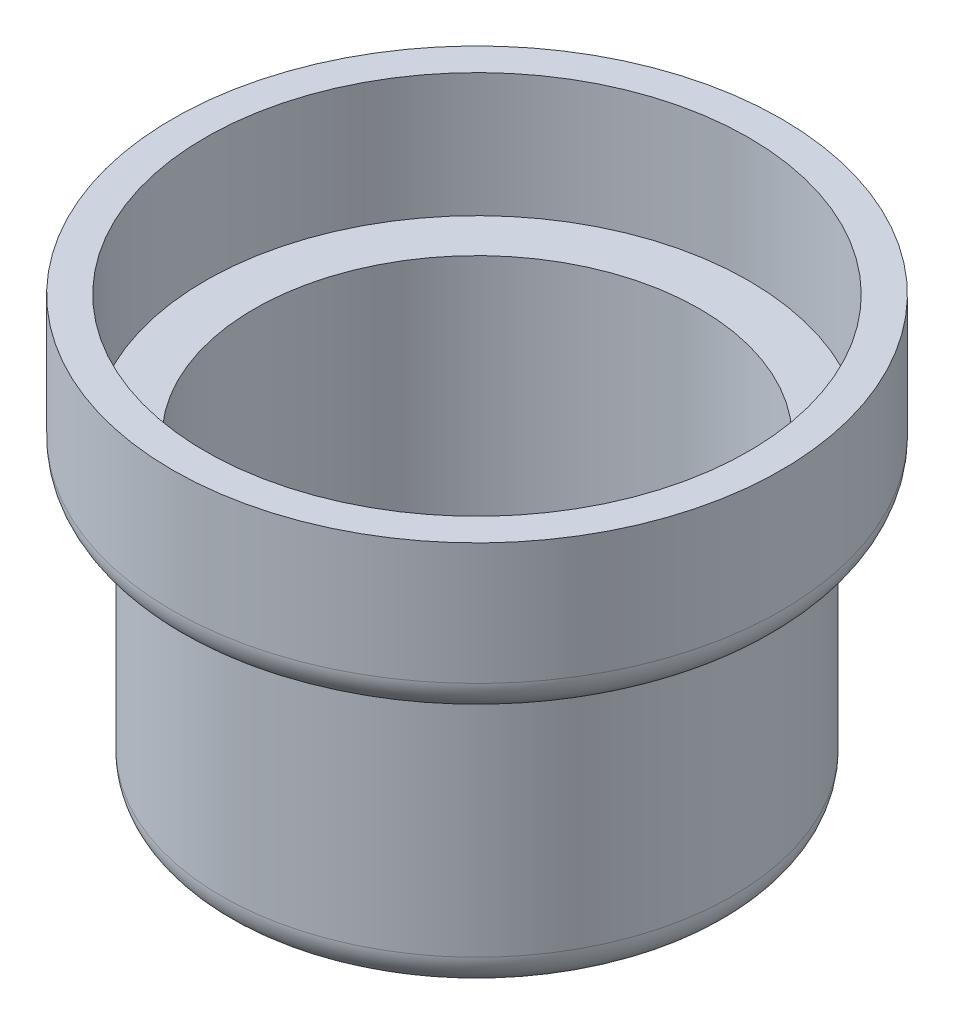
ISO-10303-21;
HEADER;
FILE_DESCRIPTION(('STEP AP214'),'2;1');
FILE_NAME('part.step','',(''),(''),'','','');
FILE_SCHEMA(('AUTOMOTIVE_DESIGN { 1 0 10303 214 1 1 1 1 }'));
ENDSEC;
DATA;
#1=APPLICATION_CONTEXT('core data for automotive mechanical design processes');
#2=APPLICATION_PROTOCOL_DEFINITION('international standard','automotive_design',2000,#1);
#3=PRODUCT_CONTEXT('',#1,'mechanical');
#4=PRODUCT('Part','Part','',(#3));
#5=PRODUCT_RELATED_PRODUCT_CATEGORY('part','',(#4));
#6=PRODUCT_DEFINITION_FORMATION('','',#4);
#7=PRODUCT_DEFINITION_CONTEXT('part definition',#1,'design');
#8=PRODUCT_DEFINITION('design','',#6,#7);
#9=PRODUCT_DEFINITION_SHAPE('','',#8);
#10=(LENGTH_UNIT() NAMED_UNIT(*) SI_UNIT(.MILLI.,.METRE.));
#11=(NAMED_UNIT(*) PLANE_ANGLE_UNIT() SI_UNIT($,.RADIAN.));
#12=(NAMED_UNIT(*) SI_UNIT($,.STERADIAN.) SOLID_ANGLE_UNIT());
#13=UNCERTAINTY_MEASURE_WITH_UNIT(LENGTH_MEASURE(1.E-05),#10,'distance_accuracy_value','');
#14=(GEOMETRIC_REPRESENTATION_CONTEXT(3) GLOBAL_UNCERTAINTY_ASSIGNED_CONTEXT((#13)) GLOBAL_UNIT_ASSIGNED_CONTEXT((#10,
#11,#12)) REPRESENTATION_CONTEXT('',''));
#15=CARTESIAN_POINT('',(0.,0.,0.));
#16=DIRECTION('',(0.,0.,1.));
#17=DIRECTION('',(1.,0.,0.));
#18=AXIS2_PLACEMENT_3D('',#15,#16,#17);
#19=CARTESIAN_POINT('',(0.,0.,0.));
#20=DIRECTION('',(0.,-1.,0.));
#21=DIRECTION('',(0.,0.,-1.));
#22=AXIS2_PLACEMENT_3D('',#19,#20,#21);
#23=PLANE('',#22);
#24=CARTESIAN_POINT('',(0.,0.,0.));
#25=DIRECTION('',(0.,-1.,0.));
#26=DIRECTION('',(0.,0.,-1.));
#27=AXIS2_PLACEMENT_3D('',#24,#25,#26);
#28=CIRCLE('',#27,16.113125);
#29=CARTESIAN_POINT('',(0.,0.,-16.113125));
#30=VERTEX_POINT('',#29);
#31=EDGE_CURVE('E46',#30,#30,#28,.T.);
#32=ORIENTED_EDGE('',*,*,#31,.T.);
#33=EDGE_LOOP('',(#32));
#34=FACE_BOUND('',#33,.T.);
#35=ADVANCED_FACE('F31',(#34),#23,.T.);
#36=CARTESIAN_POINT('',(0.,0.,0.));
#37=DIRECTION('',(0.,-1.,0.));
#38=DIRECTION('',(0.,0.,-1.));
#39=AXIS2_PLACEMENT_3D('',#36,#37,#38);
#40=CYLINDRICAL_SURFACE('',#39,18.653125);
#41=CARTESIAN_POINT('',(0.,2.54,0.));
#42=DIRECTION('',(0.,-1.,0.));
#43=DIRECTION('',(0.,0.,-1.));
#44=AXIS2_PLACEMENT_3D('',#41,#42,#43);
#45=CIRCLE('',#44,18.653125);
#46=CARTESIAN_POINT('',(0.,2.54,-18.653125));
#47=VERTEX_POINT('',#46);
#48=EDGE_CURVE('E42',#47,#47,#45,.F.);
#49=ORIENTED_EDGE('',*,*,#48,.T.);
#50=EDGE_LOOP('',(#49));
#51=FACE_BOUND('',#50,.T.);
#52=CARTESIAN_POINT('',(0.,19.84375,0.));
#53=DIRECTION('',(0.,-1.,0.));
#54=DIRECTION('',(0.,0.,-1.));
#55=AXIS2_PLACEMENT_3D('',#52,#53,#54);
#56=CIRCLE('',#55,18.653125);
#57=CARTESIAN_POINT('',(0.,19.84375,-18.653125));
#58=VERTEX_POINT('',#57);
#59=EDGE_CURVE('E51',#58,#58,#56,.T.);
#60=ORIENTED_EDGE('',*,*,#59,.T.);
#61=EDGE_LOOP('',(#60));
#62=FACE_BOUND('',#61,.T.);
#63=ADVANCED_FACE('F85',(#51,#62),#40,.T.);
#64=CARTESIAN_POINT('',(18.653125,19.84375,0.));
#65=DIRECTION('',(0.,-1.,0.));
#66=DIRECTION('',(0.,0.,-1.));
#67=AXIS2_PLACEMENT_3D('',#64,#65,#66);
#68=PLANE('',#67);
#69=CARTESIAN_POINT('',(0.,19.84375,0.));
#70=DIRECTION('',(0.,-1.,0.));
#71=DIRECTION('',(0.,0.,-1.));
#72=AXIS2_PLACEMENT_3D('',#69,#70,#71);
#73=CIRCLE('',#72,19.685);
#74=CARTESIAN_POINT('',(0.,19.84375,-19.685));
#75=VERTEX_POINT('',#74);
#76=EDGE_CURVE('E38',#75,#75,#73,.T.);
#77=ORIENTED_EDGE('',*,*,#76,.T.);
#78=EDGE_LOOP('',(#77));
#79=FACE_BOUND('',#78,.T.);
#80=ORIENTED_EDGE('',*,*,#59,.F.);
#81=EDGE_LOOP('',(#80));
#82=FACE_BOUND('',#81,.T.);
#83=ADVANCED_FACE('F91',(#79,#82),#68,.T.);
#84=CARTESIAN_POINT('',(0.,0.,0.));
#85=DIRECTION('',(0.,-1.,0.));
#86=DIRECTION('',(0.,0.,-1.));
#87=AXIS2_PLACEMENT_3D('',#84,#85,#86);
#88=CYLINDRICAL_SURFACE('',#87,22.225);
#89=CARTESIAN_POINT('',(0.,22.38375,0.));
#90=DIRECTION('',(0.,-1.,0.));
#91=DIRECTION('',(0.,0.,-1.));
#92=AXIS2_PLACEMENT_3D('',#89,#90,#91);
#93=CIRCLE('',#92,22.225);
#94=CARTESIAN_POINT('',(0.,22.38375,-22.225));
#95=VERTEX_POINT('',#94);
#96=EDGE_CURVE('E10',#95,#95,#93,.F.);
#97=ORIENTED_EDGE('',*,*,#96,.T.);
#98=EDGE_LOOP('',(#97));
#99=FACE_BOUND('',#98,.T.);
#100=CARTESIAN_POINT('',(0.,31.27375,0.));
#101=DIRECTION('',(0.,-1.,0.));
#102=DIRECTION('',(0.,0.,-1.));
#103=AXIS2_PLACEMENT_3D('',#100,#101,#102);
#104=CIRCLE('',#103,22.225);
#105=CARTESIAN_POINT('',(0.,31.27375,-22.225));
#106=VERTEX_POINT('',#105);
#107=EDGE_CURVE('E54',#106,#106,#104,.T.);
#108=ORIENTED_EDGE('',*,*,#107,.T.);
#109=EDGE_LOOP('',(#108));
#110=FACE_BOUND('',#109,.T.);
#111=ADVANCED_FACE('F97',(#99,#110),#88,.T.);
#112=CARTESIAN_POINT('',(22.225,31.27375,0.));
#113=DIRECTION('',(0.,1.,0.));
#114=DIRECTION('',(0.,0.,1.));
#115=AXIS2_PLACEMENT_3D('',#112,#113,#114);
#116=PLANE('',#115);
#117=CARTESIAN_POINT('',(0.,31.27375,0.));
#118=DIRECTION('',(0.,-1.,0.));
#119=DIRECTION('',(0.,0.,-1.));
#120=AXIS2_PLACEMENT_3D('',#117,#118,#119);
#121=CIRCLE('',#120,19.84375);
#122=CARTESIAN_POINT('',(0.,31.27375,-19.84375));
#123=VERTEX_POINT('',#122);
#124=EDGE_CURVE('E57',#123,#123,#121,.T.);
#125=ORIENTED_EDGE('',*,*,#124,.T.);
#126=EDGE_LOOP('',(#125));
#127=FACE_BOUND('',#126,.T.);
#128=ORIENTED_EDGE('',*,*,#107,.F.);
#129=EDGE_LOOP('',(#128));
#130=FACE_BOUND('',#129,.T.);
#131=ADVANCED_FACE('F100',(#127,#130),#116,.T.);
#132=CARTESIAN_POINT('',(0.,0.,0.));
#133=DIRECTION('',(0.,-1.,0.));
#134=DIRECTION('',(0.,0.,-1.));
#135=AXIS2_PLACEMENT_3D('',#132,#133,#134);
#136=CYLINDRICAL_SURFACE('',#135,19.84375);
#137=CARTESIAN_POINT('',(0.,22.225,0.));
#138=DIRECTION('',(0.,-1.,0.));
#139=DIRECTION('',(0.,0.,-1.));
#140=AXIS2_PLACEMENT_3D('',#137,#138,#139);
#141=CIRCLE('',#140,19.84375);
#142=CARTESIAN_POINT('',(0.,22.225,-19.84375));
#143=VERTEX_POINT('',#142);
#144=EDGE_CURVE('E60',#143,#143,#141,.T.);
#145=ORIENTED_EDGE('',*,*,#144,.T.);
#146=EDGE_LOOP('',(#145));
#147=FACE_BOUND('',#146,.T.);
#148=ORIENTED_EDGE('',*,*,#124,.F.);
#149=EDGE_LOOP('',(#148));
#150=FACE_BOUND('',#149,.T.);
#151=ADVANCED_FACE('F103',(#147,#150),#136,.F.);
#152=CARTESIAN_POINT('',(19.84375,22.225,0.));
#153=DIRECTION('',(0.,1.,0.));
#154=DIRECTION('',(0.,0.,1.));
#155=AXIS2_PLACEMENT_3D('',#152,#153,#154);
#156=PLANE('',#155);
#157=CARTESIAN_POINT('',(0.,22.225,0.));
#158=DIRECTION('',(0.,-1.,0.));
#159=DIRECTION('',(0.,0.,-1.));
#160=AXIS2_PLACEMENT_3D('',#157,#158,#159);
#161=CIRCLE('',#160,16.271875);
#162=CARTESIAN_POINT('',(0.,22.225,-16.271875));
#163=VERTEX_POINT('',#162);
#164=EDGE_CURVE('E63',#163,#163,#161,.T.);
#165=ORIENTED_EDGE('',*,*,#164,.T.);
#166=EDGE_LOOP('',(#165));
#167=FACE_BOUND('',#166,.T.);
#168=ORIENTED_EDGE('',*,*,#144,.F.);
#169=EDGE_LOOP('',(#168));
#170=FACE_BOUND('',#169,.T.);
#171=ADVANCED_FACE('F82',(#167,#170),#156,.T.);
#172=CARTESIAN_POINT('',(0.,0.,0.));
#173=DIRECTION('',(0.,-1.,0.));
#174=DIRECTION('',(0.,0.,-1.));
#175=AXIS2_PLACEMENT_3D('',#172,#173,#174);
#176=CYLINDRICAL_SURFACE('',#175,16.271875);
#177=CARTESIAN_POINT('',(0.,2.38125,0.));
#178=DIRECTION('',(0.,-1.,0.));
#179=DIRECTION('',(0.,0.,-1.));
#180=AXIS2_PLACEMENT_3D('',#177,#178,#179);
#181=CIRCLE('',#180,16.271875);
#182=CARTESIAN_POINT('',(0.,2.38125,-16.271875));
#183=VERTEX_POINT('',#182);
#184=EDGE_CURVE('E66',#183,#183,#181,.T.);
#185=ORIENTED_EDGE('',*,*,#184,.T.);
#186=EDGE_LOOP('',(#185));
#187=FACE_BOUND('',#186,.T.);
#188=ORIENTED_EDGE('',*,*,#164,.F.);
#189=EDGE_LOOP('',(#188));
#190=FACE_BOUND('',#189,.T.);
#191=ADVANCED_FACE('F70',(#187,#190),#176,.F.);
#192=CARTESIAN_POINT('',(16.271875,2.38125,0.));
#193=DIRECTION('',(0.,1.,0.));
#194=DIRECTION('',(0.,0.,1.));
#195=AXIS2_PLACEMENT_3D('',#192,#193,#194);
#196=PLANE('',#195);
#197=ORIENTED_EDGE('',*,*,#184,.F.);
#198=EDGE_LOOP('',(#197));
#199=FACE_BOUND('',#198,.T.);
#200=ADVANCED_FACE('F73',(#199),#196,.T.);
#201=CARTESIAN_POINT('',(0.,2.54,0.));
#202=DIRECTION('',(0.,-1.,0.));
#203=DIRECTION('',(0.,0.,-1.));
#204=AXIS2_PLACEMENT_3D('',#201,#202,#203);
#205=TOROIDAL_SURFACE('',#204,16.113125,2.54);
#206=ORIENTED_EDGE('',*,*,#48,.F.);
#207=EDGE_LOOP('',(#206));
#208=FACE_BOUND('',#207,.T.);
#209=ORIENTED_EDGE('',*,*,#31,.F.);
#210=EDGE_LOOP('',(#209));
#211=FACE_BOUND('',#210,.T.);
#212=ADVANCED_FACE('F75',(#208,#211),#205,.T.);
#213=CARTESIAN_POINT('',(0.,22.38375,0.));
#214=DIRECTION('',(0.,-1.,0.));
#215=DIRECTION('',(0.,0.,-1.));
#216=AXIS2_PLACEMENT_3D('',#213,#214,#215);
#217=TOROIDAL_SURFACE('',#216,19.685,2.54);
#218=ORIENTED_EDGE('',*,*,#96,.F.);
#219=EDGE_LOOP('',(#218));
#220=FACE_BOUND('',#219,.T.);
#221=ORIENTED_EDGE('',*,*,#76,.F.);
#222=EDGE_LOOP('',(#221));
#223=FACE_BOUND('',#222,.T.);
#224=ADVANCED_FACE('F33',(#220,#223),#217,.T.);
#225=CLOSED_SHELL('',(#35,#63,#83,#111,#131,#151,#171,#191,#200,#212,#224));
#226=MANIFOLD_SOLID_BREP('B2',#225);
#227=ADVANCED_BREP_SHAPE_REPRESENTATION('',(#18,#226),#14);
#228=SHAPE_DEFINITION_REPRESENTATION(#9,#227);
ENDSEC;
END-ISO-10303-21;
